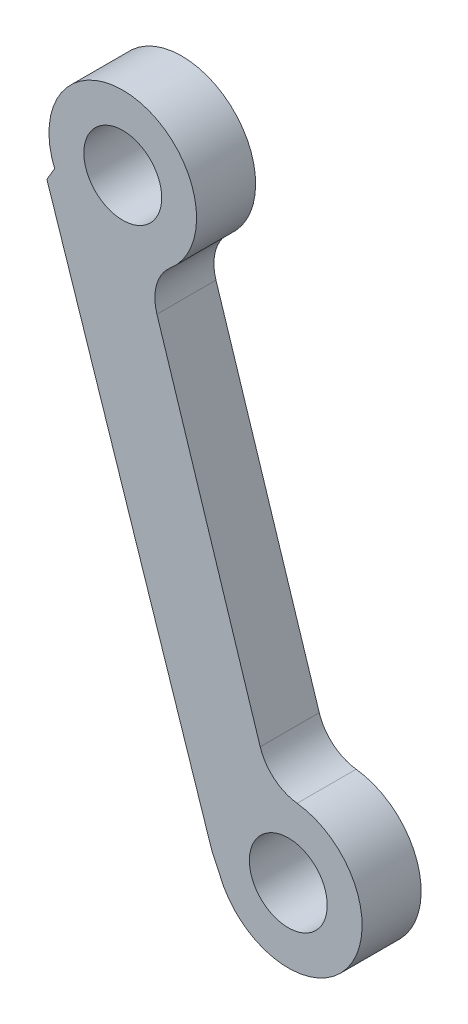
ISO-10303-21;
HEADER;
FILE_DESCRIPTION(('STEP AP214'),'2;1');
FILE_NAME('part.step','',(''),(''),'','','');
FILE_SCHEMA(('AUTOMOTIVE_DESIGN { 1 0 10303 214 1 1 1 1 }'));
ENDSEC;
DATA;
#1=APPLICATION_CONTEXT('core data for automotive mechanical design processes');
#2=APPLICATION_PROTOCOL_DEFINITION('international standard','automotive_design',2000,#1);
#3=PRODUCT_CONTEXT('',#1,'mechanical');
#4=PRODUCT('Part','Part','',(#3));
#5=PRODUCT_RELATED_PRODUCT_CATEGORY('part','',(#4));
#6=PRODUCT_DEFINITION_FORMATION('','',#4);
#7=PRODUCT_DEFINITION_CONTEXT('part definition',#1,'design');
#8=PRODUCT_DEFINITION('design','',#6,#7);
#9=PRODUCT_DEFINITION_SHAPE('','',#8);
#10=(LENGTH_UNIT() NAMED_UNIT(*) SI_UNIT(.MILLI.,.METRE.));
#11=(NAMED_UNIT(*) PLANE_ANGLE_UNIT() SI_UNIT($,.RADIAN.));
#12=(NAMED_UNIT(*) SI_UNIT($,.STERADIAN.) SOLID_ANGLE_UNIT());
#13=UNCERTAINTY_MEASURE_WITH_UNIT(LENGTH_MEASURE(1.E-05),#10,'distance_accuracy_value','');
#14=(GEOMETRIC_REPRESENTATION_CONTEXT(3) GLOBAL_UNCERTAINTY_ASSIGNED_CONTEXT((#13)) GLOBAL_UNIT_ASSIGNED_CONTEXT((#10,
#11,#12)) REPRESENTATION_CONTEXT('',''));
#15=CARTESIAN_POINT('',(0.,0.,0.));
#16=DIRECTION('',(0.,0.,1.));
#17=DIRECTION('',(1.,0.,0.));
#18=AXIS2_PLACEMENT_3D('',#15,#16,#17);
#19=CARTESIAN_POINT('',(19.8561963211169,50.4190268246602,0.));
#20=DIRECTION('',(0.,0.,1.));
#21=DIRECTION('',(1.,0.,0.));
#22=AXIS2_PLACEMENT_3D('',#19,#20,#21);
#23=CYLINDRICAL_SURFACE('',#22,5.00000000000015);
#24=CARTESIAN_POINT('',(19.8561963211169,50.4190268246602,4.));
#25=DIRECTION('',(0.,0.,1.));
#26=DIRECTION('',(1.,0.,0.));
#27=AXIS2_PLACEMENT_3D('',#24,#25,#26);
#28=CIRCLE('',#27,5.00000000000015);
#29=CARTESIAN_POINT('',(15.2000717509368,48.5968018146884,4.));
#30=VERTEX_POINT('',#29);
#31=CARTESIAN_POINT('',(20.4520730980895,55.3833929339098,4.));
#32=VERTEX_POINT('',#31);
#33=EDGE_CURVE('E129',#30,#32,#28,.T.);
#34=ORIENTED_EDGE('',*,*,#33,.F.);
#35=DIRECTION('',(0.,0.,1.));
#36=VECTOR('',#35,1.);
#37=CARTESIAN_POINT('',(15.2000717509368,48.5968018146884,0.));
#38=LINE('',#37,#36);
#39=CARTESIAN_POINT('',(15.2000717509368,48.5968018146884,0.));
#40=VERTEX_POINT('',#39);
#41=EDGE_CURVE('E11',#40,#30,#38,.T.);
#42=ORIENTED_EDGE('',*,*,#41,.F.);
#43=CARTESIAN_POINT('',(19.8561963211169,50.4190268246602,0.));
#44=DIRECTION('',(0.,0.,1.));
#45=DIRECTION('',(1.,0.,0.));
#46=AXIS2_PLACEMENT_3D('',#43,#44,#45);
#47=CIRCLE('',#46,5.00000000000015);
#48=CARTESIAN_POINT('',(20.4520730980895,55.3833929339098,0.));
#49=VERTEX_POINT('',#48);
#50=EDGE_CURVE('E150',#40,#49,#47,.T.);
#51=ORIENTED_EDGE('',*,*,#50,.T.);
#52=DIRECTION('',(0.,0.,1.));
#53=VECTOR('',#52,1.);
#54=CARTESIAN_POINT('',(20.4520730980895,55.3833929339098,0.));
#55=LINE('',#54,#53);
#56=EDGE_CURVE('E35',#49,#32,#55,.T.);
#57=ORIENTED_EDGE('',*,*,#56,.T.);
#58=EDGE_LOOP('',(#34,#42,#51,#57));
#59=FACE_BOUND('',#58,.T.);
#60=ADVANCED_FACE('F32',(#59),#23,.T.);
#61=CARTESIAN_POINT('',(14.6726536814549,49.7282628827833,0.));
#62=DIRECTION('',(-0.906366348257283,-0.422492654074313,0.));
#63=DIRECTION('',(0.422492654074313,-0.906366348257283,0.));
#64=AXIS2_PLACEMENT_3D('',#61,#62,#63);
#65=PLANE('',#64);
#66=DIRECTION('',(0.422492654074313,-0.906366348257283,0.));
#67=VECTOR('',#66,1.);
#68=CARTESIAN_POINT('',(14.6726536814549,49.7282628827833,4.));
#69=LINE('',#68,#67);
#70=CARTESIAN_POINT('',(14.6726536814549,49.7282628827833,4.));
#71=VERTEX_POINT('',#70);
#72=EDGE_CURVE('E148',#71,#30,#69,.T.);
#73=ORIENTED_EDGE('',*,*,#72,.F.);
#74=DIRECTION('',(0.,0.,1.));
#75=VECTOR('',#74,1.);
#76=CARTESIAN_POINT('',(14.6726536814549,49.7282628827833,0.));
#77=LINE('',#76,#75);
#78=CARTESIAN_POINT('',(14.6726536814549,49.7282628827833,0.));
#79=VERTEX_POINT('',#78);
#80=EDGE_CURVE('E41',#79,#71,#77,.T.);
#81=ORIENTED_EDGE('',*,*,#80,.F.);
#82=DIRECTION('',(0.422492654074313,-0.906366348257283,0.));
#83=VECTOR('',#82,1.);
#84=CARTESIAN_POINT('',(14.6726536814549,49.7282628827833,0.));
#85=LINE('',#84,#83);
#86=EDGE_CURVE('E119',#79,#40,#85,.T.);
#87=ORIENTED_EDGE('',*,*,#86,.T.);
#88=ORIENTED_EDGE('',*,*,#41,.T.);
#89=EDGE_LOOP('',(#73,#81,#87,#88));
#90=FACE_BOUND('',#89,.T.);
#91=ADVANCED_FACE('F162',(#90),#65,.T.);
#92=CARTESIAN_POINT('',(3.50029269762217,83.5205023302749,0.));
#93=DIRECTION('',(-0.949453564490203,-0.313907516438916,0.));
#94=DIRECTION('',(0.313907516438916,-0.949453564490203,0.));
#95=AXIS2_PLACEMENT_3D('',#92,#93,#94);
#96=PLANE('',#95);
#97=DIRECTION('',(0.313907516438916,-0.949453564490203,0.));
#98=VECTOR('',#97,1.);
#99=CARTESIAN_POINT('',(3.50029269762217,83.5205023302749,4.));
#100=LINE('',#99,#98);
#101=CARTESIAN_POINT('',(3.50029269762217,83.5205023302749,4.));
#102=VERTEX_POINT('',#101);
#103=EDGE_CURVE('E106',#102,#71,#100,.T.);
#104=ORIENTED_EDGE('',*,*,#103,.F.);
#105=DIRECTION('',(0.,0.,1.));
#106=VECTOR('',#105,1.);
#107=CARTESIAN_POINT('',(3.50029269762217,83.5205023302749,0.));
#108=LINE('',#107,#106);
#109=CARTESIAN_POINT('',(3.50029269762217,83.5205023302749,0.));
#110=VERTEX_POINT('',#109);
#111=EDGE_CURVE('E101',#110,#102,#108,.T.);
#112=ORIENTED_EDGE('',*,*,#111,.F.);
#113=DIRECTION('',(0.313907516438916,-0.949453564490203,0.));
#114=VECTOR('',#113,1.);
#115=CARTESIAN_POINT('',(3.50029269762217,83.5205023302749,0.));
#116=LINE('',#115,#114);
#117=EDGE_CURVE('E104',#110,#79,#116,.T.);
#118=ORIENTED_EDGE('',*,*,#117,.T.);
#119=ORIENTED_EDGE('',*,*,#80,.T.);
#120=EDGE_LOOP('',(#104,#112,#118,#119));
#121=FACE_BOUND('',#120,.T.);
#122=ADVANCED_FACE('F103',(#121),#96,.T.);
#123=CARTESIAN_POINT('',(4.0227869680731,84.4073711711635,0.));
#124=DIRECTION('',(-0.861591516947739,0.50760226351317,0.));
#125=DIRECTION('',(-0.50760226351317,-0.861591516947739,0.));
#126=AXIS2_PLACEMENT_3D('',#123,#124,#125);
#127=PLANE('',#126);
#128=DIRECTION('',(-0.50760226351317,-0.861591516947739,0.));
#129=VECTOR('',#128,1.);
#130=CARTESIAN_POINT('',(4.0227869680731,84.4073711711635,4.));
#131=LINE('',#130,#129);
#132=CARTESIAN_POINT('',(4.0227869680731,84.4073711711635,4.));
#133=VERTEX_POINT('',#132);
#134=EDGE_CURVE('E145',#133,#102,#131,.T.);
#135=ORIENTED_EDGE('',*,*,#134,.F.);
#136=DIRECTION('',(0.,0.,1.));
#137=VECTOR('',#136,1.);
#138=CARTESIAN_POINT('',(4.0227869680731,84.4073711711635,0.));
#139=LINE('',#138,#137);
#140=CARTESIAN_POINT('',(4.0227869680731,84.4073711711635,0.));
#141=VERTEX_POINT('',#140);
#142=EDGE_CURVE('E111',#141,#133,#139,.T.);
#143=ORIENTED_EDGE('',*,*,#142,.F.);
#144=DIRECTION('',(-0.50760226351317,-0.861591516947739,0.));
#145=VECTOR('',#144,1.);
#146=CARTESIAN_POINT('',(4.0227869680731,84.4073711711635,0.));
#147=LINE('',#146,#145);
#148=EDGE_CURVE('E117',#141,#110,#147,.T.);
#149=ORIENTED_EDGE('',*,*,#148,.T.);
#150=ORIENTED_EDGE('',*,*,#111,.T.);
#151=EDGE_LOOP('',(#135,#143,#149,#150));
#152=FACE_BOUND('',#151,.T.);
#153=ADVANCED_FACE('F121',(#152),#127,.T.);
#154=CARTESIAN_POINT('',(8.64095175779587,86.3237620433409,0.));
#155=DIRECTION('',(0.,0.,1.));
#156=DIRECTION('',(1.,0.,0.));
#157=AXIS2_PLACEMENT_3D('',#154,#155,#156);
#158=CYLINDRICAL_SURFACE('',#157,4.99999999999999);
#159=CARTESIAN_POINT('',(8.64095175779587,86.3237620433409,4.));
#160=DIRECTION('',(0.,0.,1.));
#161=DIRECTION('',(1.,0.,0.));
#162=AXIS2_PLACEMENT_3D('',#159,#160,#161);
#163=CIRCLE('',#162,4.99999999999999);
#164=CARTESIAN_POINT('',(11.8672043416001,82.5039067757298,4.));
#165=VERTEX_POINT('',#164);
#166=EDGE_CURVE('E142',#165,#133,#163,.T.);
#167=ORIENTED_EDGE('',*,*,#166,.F.);
#168=DIRECTION('',(0.,0.,1.));
#169=VECTOR('',#168,1.);
#170=CARTESIAN_POINT('',(11.8672043416001,82.5039067757298,0.));
#171=LINE('',#170,#169);
#172=CARTESIAN_POINT('',(11.8672043416001,82.5039067757298,0.));
#173=VERTEX_POINT('',#172);
#174=EDGE_CURVE('E154',#173,#165,#171,.T.);
#175=ORIENTED_EDGE('',*,*,#174,.F.);
#176=CARTESIAN_POINT('',(8.64095175779587,86.3237620433409,0.));
#177=DIRECTION('',(0.,0.,1.));
#178=DIRECTION('',(1.,0.,0.));
#179=AXIS2_PLACEMENT_3D('',#176,#177,#178);
#180=CIRCLE('',#179,4.99999999999999);
#181=EDGE_CURVE('E122',#173,#141,#180,.T.);
#182=ORIENTED_EDGE('',*,*,#181,.T.);
#183=ORIENTED_EDGE('',*,*,#142,.T.);
#184=EDGE_LOOP('',(#167,#175,#182,#183));
#185=FACE_BOUND('',#184,.T.);
#186=ADVANCED_FACE('F175',(#185),#158,.T.);
#187=CARTESIAN_POINT('',(13.7827936691317,80.2358655132188,0.));
#188=DIRECTION('',(0.,0.,1.));
#189=DIRECTION('',(1.,0.,0.));
#190=AXIS2_PLACEMENT_3D('',#187,#188,#189);
#191=CYLINDRICAL_SURFACE('',#190,2.96875287624372);
#192=CARTESIAN_POINT('',(13.7827936691317,80.2358655132188,4.));
#193=DIRECTION('',(0.,0.,-1.));
#194=DIRECTION('',(-1.,0.,0.));
#195=AXIS2_PLACEMENT_3D('',#192,#193,#194);
#196=CIRCLE('',#195,2.96875287624372);
#197=CARTESIAN_POINT('',(10.9550704415828,79.331722278667,4.));
#198=VERTEX_POINT('',#197);
#199=EDGE_CURVE('E139',#198,#165,#196,.T.);
#200=ORIENTED_EDGE('',*,*,#199,.F.);
#201=DIRECTION('',(0.,0.,1.));
#202=VECTOR('',#201,1.);
#203=CARTESIAN_POINT('',(10.9550704415828,79.331722278667,0.));
#204=LINE('',#203,#202);
#205=CARTESIAN_POINT('',(10.9550704415828,79.331722278667,0.));
#206=VERTEX_POINT('',#205);
#207=EDGE_CURVE('E156',#206,#198,#204,.T.);
#208=ORIENTED_EDGE('',*,*,#207,.F.);
#209=CARTESIAN_POINT('',(13.7827936691317,80.2358655132188,0.));
#210=DIRECTION('',(0.,0.,-1.));
#211=DIRECTION('',(-1.,0.,0.));
#212=AXIS2_PLACEMENT_3D('',#209,#210,#211);
#213=CIRCLE('',#212,2.96875287624372);
#214=EDGE_CURVE('E124',#206,#173,#213,.T.);
#215=ORIENTED_EDGE('',*,*,#214,.T.);
#216=ORIENTED_EDGE('',*,*,#174,.T.);
#217=EDGE_LOOP('',(#200,#208,#215,#216));
#218=FACE_BOUND('',#217,.T.);
#219=ADVANCED_FACE('F178',(#218),#191,.F.);
#220=CARTESIAN_POINT('',(17.9521131975128,57.4483529528916,0.));
#221=DIRECTION('',(0.952495322253554,0.304553215522505,0.));
#222=DIRECTION('',(-0.304553215522505,0.952495322253554,0.));
#223=AXIS2_PLACEMENT_3D('',#220,#221,#222);
#224=PLANE('',#223);
#225=DIRECTION('',(-0.304553215522505,0.952495322253554,0.));
#226=VECTOR('',#225,1.);
#227=CARTESIAN_POINT('',(17.9521131975128,57.4483529528916,4.));
#228=LINE('',#227,#226);
#229=CARTESIAN_POINT('',(17.9521131975128,57.4483529528916,4.));
#230=VERTEX_POINT('',#229);
#231=EDGE_CURVE('E136',#230,#198,#228,.T.);
#232=ORIENTED_EDGE('',*,*,#231,.F.);
#233=DIRECTION('',(0.,0.,1.));
#234=VECTOR('',#233,1.);
#235=CARTESIAN_POINT('',(17.9521131975128,57.4483529528916,0.));
#236=LINE('',#235,#234);
#237=CARTESIAN_POINT('',(17.9521131975128,57.4483529528916,0.));
#238=VERTEX_POINT('',#237);
#239=EDGE_CURVE('E157',#238,#230,#236,.T.);
#240=ORIENTED_EDGE('',*,*,#239,.F.);
#241=DIRECTION('',(-0.304553215522505,0.952495322253554,0.));
#242=VECTOR('',#241,1.);
#243=CARTESIAN_POINT('',(17.9521131975128,57.4483529528916,0.));
#244=LINE('',#243,#242);
#245=EDGE_CURVE('E224',#238,#206,#244,.T.);
#246=ORIENTED_EDGE('',*,*,#245,.T.);
#247=ORIENTED_EDGE('',*,*,#207,.T.);
#248=EDGE_LOOP('',(#232,#240,#246,#247));
#249=FACE_BOUND('',#248,.T.);
#250=ADVANCED_FACE('F182',(#249),#224,.T.);
#251=CARTESIAN_POINT('',(20.809599164273,58.362012599459,0.));
#252=DIRECTION('',(0.,0.,1.));
#253=DIRECTION('',(1.,0.,0.));
#254=AXIS2_PLACEMENT_3D('',#251,#252,#253);
#255=CYLINDRICAL_SURFACE('',#254,2.99999999999953);
#256=CARTESIAN_POINT('',(20.809599164273,58.362012599459,4.));
#257=DIRECTION('',(0.,0.,-1.));
#258=DIRECTION('',(-1.,0.,0.));
#259=AXIS2_PLACEMENT_3D('',#256,#257,#258);
#260=CIRCLE('',#259,2.99999999999953);
#261=EDGE_CURVE('E132',#32,#230,#260,.T.);
#262=ORIENTED_EDGE('',*,*,#261,.F.);
#263=ORIENTED_EDGE('',*,*,#56,.F.);
#264=CARTESIAN_POINT('',(20.809599164273,58.362012599459,0.));
#265=DIRECTION('',(0.,0.,-1.));
#266=DIRECTION('',(-1.,0.,0.));
#267=AXIS2_PLACEMENT_3D('',#264,#265,#266);
#268=CIRCLE('',#267,2.99999999999953);
#269=EDGE_CURVE('E222',#49,#238,#268,.T.);
#270=ORIENTED_EDGE('',*,*,#269,.T.);
#271=ORIENTED_EDGE('',*,*,#239,.T.);
#272=EDGE_LOOP('',(#262,#263,#270,#271));
#273=FACE_BOUND('',#272,.T.);
#274=ADVANCED_FACE('F159',(#273),#255,.F.);
#275=CARTESIAN_POINT('',(19.8561963211169,50.4190268246602,0.));
#276=DIRECTION('',(0.,0.,1.));
#277=DIRECTION('',(1.,0.,0.));
#278=AXIS2_PLACEMENT_3D('',#275,#276,#277);
#279=PLANE('',#278);
#280=CARTESIAN_POINT('',(8.64095175779587,86.3237620433409,0.));
#281=DIRECTION('',(0.,0.,1.));
#282=DIRECTION('',(-1.,0.,0.));
#283=AXIS2_PLACEMENT_3D('',#280,#281,#282);
#284=CIRCLE('',#283,2.63749999999999);
#285=CARTESIAN_POINT('',(6.00345175779588,86.3237620433409,0.));
#286=VERTEX_POINT('',#285);
#287=EDGE_CURVE('E209',#286,#286,#284,.T.);
#288=ORIENTED_EDGE('',*,*,#287,.T.);
#289=EDGE_LOOP('',(#288));
#290=FACE_BOUND('',#289,.T.);
#291=CARTESIAN_POINT('',(19.8561963211169,50.4190268246602,0.));
#292=DIRECTION('',(0.,0.,1.));
#293=DIRECTION('',(-1.,0.,0.));
#294=AXIS2_PLACEMENT_3D('',#291,#292,#293);
#295=CIRCLE('',#294,2.6375);
#296=CARTESIAN_POINT('',(17.2186963211169,50.4190268246602,0.));
#297=VERTEX_POINT('',#296);
#298=EDGE_CURVE('E133',#297,#297,#295,.T.);
#299=ORIENTED_EDGE('',*,*,#298,.T.);
#300=EDGE_LOOP('',(#299));
#301=FACE_BOUND('',#300,.T.);
#302=ORIENTED_EDGE('',*,*,#50,.F.);
#303=ORIENTED_EDGE('',*,*,#86,.F.);
#304=ORIENTED_EDGE('',*,*,#117,.F.);
#305=ORIENTED_EDGE('',*,*,#148,.F.);
#306=ORIENTED_EDGE('',*,*,#181,.F.);
#307=ORIENTED_EDGE('',*,*,#214,.F.);
#308=ORIENTED_EDGE('',*,*,#245,.F.);
#309=ORIENTED_EDGE('',*,*,#269,.F.);
#310=EDGE_LOOP('',(#302,#303,#304,#305,#306,#307,#308,#309));
#311=FACE_BOUND('',#310,.T.);
#312=ADVANCED_FACE('F115',(#290,#301,#311),#279,.F.);
#313=CARTESIAN_POINT('',(19.8561963211169,50.4190268246602,4.));
#314=DIRECTION('',(0.,0.,1.));
#315=DIRECTION('',(1.,0.,0.));
#316=AXIS2_PLACEMENT_3D('',#313,#314,#315);
#317=PLANE('',#316);
#318=CARTESIAN_POINT('',(8.64095175779587,86.3237620433409,4.));
#319=DIRECTION('',(0.,0.,1.));
#320=DIRECTION('',(-1.,0.,0.));
#321=AXIS2_PLACEMENT_3D('',#318,#319,#320);
#322=CIRCLE('',#321,2.63749999999999);
#323=CARTESIAN_POINT('',(6.00345175779588,86.3237620433409,4.));
#324=VERTEX_POINT('',#323);
#325=EDGE_CURVE('E212',#324,#324,#322,.T.);
#326=ORIENTED_EDGE('',*,*,#325,.F.);
#327=EDGE_LOOP('',(#326));
#328=FACE_BOUND('',#327,.T.);
#329=CARTESIAN_POINT('',(19.8561963211169,50.4190268246602,4.));
#330=DIRECTION('',(0.,0.,1.));
#331=DIRECTION('',(-1.,0.,0.));
#332=AXIS2_PLACEMENT_3D('',#329,#330,#331);
#333=CIRCLE('',#332,2.6375);
#334=CARTESIAN_POINT('',(17.2186963211169,50.4190268246602,4.));
#335=VERTEX_POINT('',#334);
#336=EDGE_CURVE('E214',#335,#335,#333,.T.);
#337=ORIENTED_EDGE('',*,*,#336,.F.);
#338=EDGE_LOOP('',(#337));
#339=FACE_BOUND('',#338,.T.);
#340=ORIENTED_EDGE('',*,*,#33,.T.);
#341=ORIENTED_EDGE('',*,*,#261,.T.);
#342=ORIENTED_EDGE('',*,*,#231,.T.);
#343=ORIENTED_EDGE('',*,*,#199,.T.);
#344=ORIENTED_EDGE('',*,*,#166,.T.);
#345=ORIENTED_EDGE('',*,*,#134,.T.);
#346=ORIENTED_EDGE('',*,*,#103,.T.);
#347=ORIENTED_EDGE('',*,*,#72,.T.);
#348=EDGE_LOOP('',(#340,#341,#342,#343,#344,#345,#346,#347));
#349=FACE_BOUND('',#348,.T.);
#350=ADVANCED_FACE('F161',(#328,#339,#349),#317,.T.);
#351=CARTESIAN_POINT('',(19.8561963211169,50.4190268246602,0.));
#352=DIRECTION('',(0.,0.,1.));
#353=DIRECTION('',(1.,0.,0.));
#354=AXIS2_PLACEMENT_3D('',#351,#352,#353);
#355=CYLINDRICAL_SURFACE('',#354,2.6375);
#356=ORIENTED_EDGE('',*,*,#298,.F.);
#357=EDGE_LOOP('',(#356));
#358=FACE_BOUND('',#357,.T.);
#359=ORIENTED_EDGE('',*,*,#336,.T.);
#360=EDGE_LOOP('',(#359));
#361=FACE_BOUND('',#360,.T.);
#362=ADVANCED_FACE('F194',(#358,#361),#355,.F.);
#363=CARTESIAN_POINT('',(8.64095175779587,86.3237620433409,0.));
#364=DIRECTION('',(0.,0.,1.));
#365=DIRECTION('',(1.,0.,0.));
#366=AXIS2_PLACEMENT_3D('',#363,#364,#365);
#367=CYLINDRICAL_SURFACE('',#366,2.63749999999999);
#368=ORIENTED_EDGE('',*,*,#287,.F.);
#369=EDGE_LOOP('',(#368));
#370=FACE_BOUND('',#369,.T.);
#371=ORIENTED_EDGE('',*,*,#325,.T.);
#372=EDGE_LOOP('',(#371));
#373=FACE_BOUND('',#372,.T.);
#374=ADVANCED_FACE('F201',(#370,#373),#367,.F.);
#375=CLOSED_SHELL('',(#60,#91,#122,#153,#186,#219,#250,#274,#312,#350,#362,#374));
#376=MANIFOLD_SOLID_BREP('B2',#375);
#377=ADVANCED_BREP_SHAPE_REPRESENTATION('',(#18,#376),#14);
#378=SHAPE_DEFINITION_REPRESENTATION(#9,#377);
ENDSEC;
END-ISO-10303-21;
